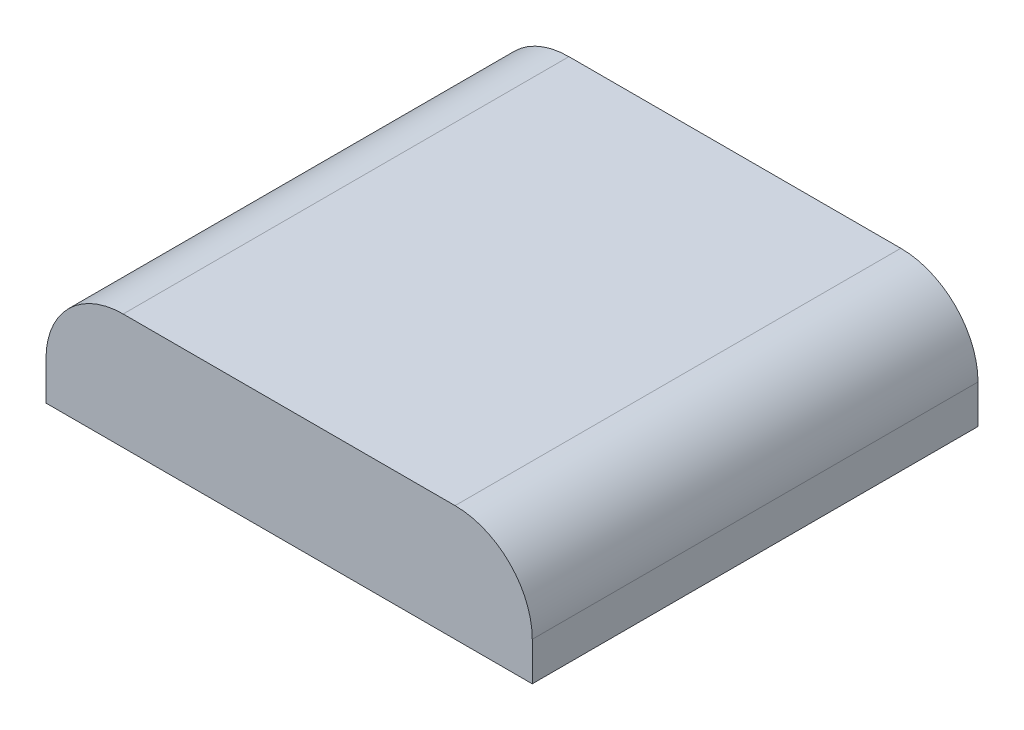
ISO-10303-21;
HEADER;
FILE_DESCRIPTION(('STEP AP214'),'2;1');
FILE_NAME('part.step','',(''),(''),'','','');
FILE_SCHEMA(('AUTOMOTIVE_DESIGN { 1 0 10303 214 1 1 1 1 }'));
ENDSEC;
DATA;
#1=APPLICATION_CONTEXT('core data for automotive mechanical design processes');
#2=APPLICATION_PROTOCOL_DEFINITION('international standard','automotive_design',2000,#1);
#3=PRODUCT_CONTEXT('',#1,'mechanical');
#4=PRODUCT('Part','Part','',(#3));
#5=PRODUCT_RELATED_PRODUCT_CATEGORY('part','',(#4));
#6=PRODUCT_DEFINITION_FORMATION('','',#4);
#7=PRODUCT_DEFINITION_CONTEXT('part definition',#1,'design');
#8=PRODUCT_DEFINITION('design','',#6,#7);
#9=PRODUCT_DEFINITION_SHAPE('','',#8);
#10=(LENGTH_UNIT() NAMED_UNIT(*) SI_UNIT(.MILLI.,.METRE.));
#11=(NAMED_UNIT(*) PLANE_ANGLE_UNIT() SI_UNIT($,.RADIAN.));
#12=(NAMED_UNIT(*) SI_UNIT($,.STERADIAN.) SOLID_ANGLE_UNIT());
#13=UNCERTAINTY_MEASURE_WITH_UNIT(LENGTH_MEASURE(1.E-05),#10,'distance_accuracy_value','');
#14=(GEOMETRIC_REPRESENTATION_CONTEXT(3) GLOBAL_UNCERTAINTY_ASSIGNED_CONTEXT((#13)) GLOBAL_UNIT_ASSIGNED_CONTEXT((#10,
#11,#12)) REPRESENTATION_CONTEXT('',''));
#15=CARTESIAN_POINT('',(0.,0.,0.));
#16=DIRECTION('',(0.,0.,1.));
#17=DIRECTION('',(1.,0.,0.));
#18=AXIS2_PLACEMENT_3D('',#15,#16,#17);
#19=CARTESIAN_POINT('',(31.5,15.,-28.875));
#20=DIRECTION('',(-1.,0.,0.));
#21=DIRECTION('',(0.,0.,1.));
#22=AXIS2_PLACEMENT_3D('',#19,#20,#21);
#23=PLANE('',#22);
#24=DIRECTION('',(0.,-1.,0.));
#25=VECTOR('',#24,1.);
#26=CARTESIAN_POINT('',(31.5,15.,-28.875));
#27=LINE('',#26,#25);
#28=CARTESIAN_POINT('',(31.5,5.,-28.875));
#29=VERTEX_POINT('',#28);
#30=CARTESIAN_POINT('',(31.5,0.,-28.875));
#31=VERTEX_POINT('',#30);
#32=EDGE_CURVE('E85',#29,#31,#27,.T.);
#33=ORIENTED_EDGE('',*,*,#32,.F.);
#34=DIRECTION('',(0.,0.,-1.));
#35=VECTOR('',#34,1.);
#36=CARTESIAN_POINT('',(31.5,5.,28.875));
#37=LINE('',#36,#35);
#38=CARTESIAN_POINT('',(31.5,5.,28.875));
#39=VERTEX_POINT('',#38);
#40=EDGE_CURVE('E56',#29,#39,#37,.F.);
#41=ORIENTED_EDGE('',*,*,#40,.T.);
#42=DIRECTION('',(0.,-1.,0.));
#43=VECTOR('',#42,1.);
#44=CARTESIAN_POINT('',(31.5,15.,28.875));
#45=LINE('',#44,#43);
#46=CARTESIAN_POINT('',(31.5,0.,28.875));
#47=VERTEX_POINT('',#46);
#48=EDGE_CURVE('E105',#39,#47,#45,.T.);
#49=ORIENTED_EDGE('',*,*,#48,.T.);
#50=DIRECTION('',(0.,0.,-1.));
#51=VECTOR('',#50,1.);
#52=CARTESIAN_POINT('',(31.5,0.,-28.875));
#53=LINE('',#52,#51);
#54=EDGE_CURVE('E101',#47,#31,#53,.T.);
#55=ORIENTED_EDGE('',*,*,#54,.T.);
#56=EDGE_LOOP('',(#33,#41,#49,#55));
#57=FACE_BOUND('',#56,.T.);
#58=ADVANCED_FACE('F33',(#57),#23,.F.);
#59=CARTESIAN_POINT('',(-31.5,15.,-28.875));
#60=DIRECTION('',(0.,0.,1.));
#61=DIRECTION('',(1.,0.,0.));
#62=AXIS2_PLACEMENT_3D('',#59,#60,#61);
#63=PLANE('',#62);
#64=DIRECTION('',(-1.,0.,0.));
#65=VECTOR('',#64,1.);
#66=CARTESIAN_POINT('',(-31.5,15.,-28.875));
#67=LINE('',#66,#65);
#68=CARTESIAN_POINT('',(21.5,15.,-28.875));
#69=VERTEX_POINT('',#68);
#70=CARTESIAN_POINT('',(-21.5,15.,-28.875));
#71=VERTEX_POINT('',#70);
#72=EDGE_CURVE('E115',#69,#71,#67,.T.);
#73=ORIENTED_EDGE('',*,*,#72,.F.);
#74=CARTESIAN_POINT('',(21.5,5.,-28.875));
#75=DIRECTION('',(0.,0.,1.));
#76=DIRECTION('',(1.,0.,0.));
#77=AXIS2_PLACEMENT_3D('',#74,#75,#76);
#78=CIRCLE('',#77,10.);
#79=EDGE_CURVE('E92',#69,#29,#78,.F.);
#80=ORIENTED_EDGE('',*,*,#79,.T.);
#81=ORIENTED_EDGE('',*,*,#32,.T.);
#82=DIRECTION('',(-1.,0.,0.));
#83=VECTOR('',#82,1.);
#84=CARTESIAN_POINT('',(-31.5,0.,-28.875));
#85=LINE('',#84,#83);
#86=CARTESIAN_POINT('',(-31.5,0.,-28.875));
#87=VERTEX_POINT('',#86);
#88=EDGE_CURVE('E90',#31,#87,#85,.T.);
#89=ORIENTED_EDGE('',*,*,#88,.T.);
#90=DIRECTION('',(0.,-1.,0.));
#91=VECTOR('',#90,1.);
#92=CARTESIAN_POINT('',(-31.5,15.,-28.875));
#93=LINE('',#92,#91);
#94=CARTESIAN_POINT('',(-31.5,5.,-28.875));
#95=VERTEX_POINT('',#94);
#96=EDGE_CURVE('E95',#95,#87,#93,.T.);
#97=ORIENTED_EDGE('',*,*,#96,.F.);
#98=CARTESIAN_POINT('',(-21.5,5.,-28.875));
#99=DIRECTION('',(0.,0.,1.));
#100=DIRECTION('',(1.,0.,0.));
#101=AXIS2_PLACEMENT_3D('',#98,#99,#100);
#102=CIRCLE('',#101,10.);
#103=EDGE_CURVE('E125',#95,#71,#102,.F.);
#104=ORIENTED_EDGE('',*,*,#103,.T.);
#105=EDGE_LOOP('',(#73,#80,#81,#89,#97,#104));
#106=FACE_BOUND('',#105,.T.);
#107=ADVANCED_FACE('F88',(#106),#63,.F.);
#108=CARTESIAN_POINT('',(-31.5,15.,-28.875));
#109=DIRECTION('',(1.,0.,0.));
#110=DIRECTION('',(0.,0.,-1.));
#111=AXIS2_PLACEMENT_3D('',#108,#109,#110);
#112=PLANE('',#111);
#113=DIRECTION('',(0.,-1.,0.));
#114=VECTOR('',#113,1.);
#115=CARTESIAN_POINT('',(-31.5,15.,28.875));
#116=LINE('',#115,#114);
#117=CARTESIAN_POINT('',(-31.5,5.,28.875));
#118=VERTEX_POINT('',#117);
#119=CARTESIAN_POINT('',(-31.5,0.,28.875));
#120=VERTEX_POINT('',#119);
#121=EDGE_CURVE('E117',#118,#120,#116,.T.);
#122=ORIENTED_EDGE('',*,*,#121,.F.);
#123=DIRECTION('',(0.,0.,1.));
#124=VECTOR('',#123,1.);
#125=CARTESIAN_POINT('',(-31.5,5.,-28.875));
#126=LINE('',#125,#124);
#127=EDGE_CURVE('E11',#118,#95,#126,.F.);
#128=ORIENTED_EDGE('',*,*,#127,.T.);
#129=ORIENTED_EDGE('',*,*,#96,.T.);
#130=DIRECTION('',(0.,0.,1.));
#131=VECTOR('',#130,1.);
#132=CARTESIAN_POINT('',(-31.5,0.,-28.875));
#133=LINE('',#132,#131);
#134=EDGE_CURVE('E103',#87,#120,#133,.T.);
#135=ORIENTED_EDGE('',*,*,#134,.T.);
#136=EDGE_LOOP('',(#122,#128,#129,#135));
#137=FACE_BOUND('',#136,.T.);
#138=ADVANCED_FACE('F151',(#137),#112,.F.);
#139=CARTESIAN_POINT('',(-31.5,15.,28.875));
#140=DIRECTION('',(0.,0.,-1.));
#141=DIRECTION('',(-1.,0.,0.));
#142=AXIS2_PLACEMENT_3D('',#139,#140,#141);
#143=PLANE('',#142);
#144=ORIENTED_EDGE('',*,*,#48,.F.);
#145=CARTESIAN_POINT('',(21.5,5.,28.875));
#146=DIRECTION('',(0.,0.,-1.));
#147=DIRECTION('',(-1.,0.,0.));
#148=AXIS2_PLACEMENT_3D('',#145,#146,#147);
#149=CIRCLE('',#148,10.);
#150=CARTESIAN_POINT('',(21.5,15.,28.875));
#151=VERTEX_POINT('',#150);
#152=EDGE_CURVE('E41',#39,#151,#149,.F.);
#153=ORIENTED_EDGE('',*,*,#152,.T.);
#154=DIRECTION('',(1.,0.,0.));
#155=VECTOR('',#154,1.);
#156=CARTESIAN_POINT('',(-31.5,15.,28.875));
#157=LINE('',#156,#155);
#158=CARTESIAN_POINT('',(-21.5,15.,28.875));
#159=VERTEX_POINT('',#158);
#160=EDGE_CURVE('E109',#159,#151,#157,.T.);
#161=ORIENTED_EDGE('',*,*,#160,.F.);
#162=CARTESIAN_POINT('',(-21.5,5.,28.875));
#163=DIRECTION('',(0.,0.,-1.));
#164=DIRECTION('',(-1.,0.,0.));
#165=AXIS2_PLACEMENT_3D('',#162,#163,#164);
#166=CIRCLE('',#165,10.);
#167=EDGE_CURVE('E48',#159,#118,#166,.F.);
#168=ORIENTED_EDGE('',*,*,#167,.T.);
#169=ORIENTED_EDGE('',*,*,#121,.T.);
#170=DIRECTION('',(1.,0.,0.));
#171=VECTOR('',#170,1.);
#172=CARTESIAN_POINT('',(-31.5,0.,28.875));
#173=LINE('',#172,#171);
#174=EDGE_CURVE('E113',#120,#47,#173,.T.);
#175=ORIENTED_EDGE('',*,*,#174,.T.);
#176=EDGE_LOOP('',(#144,#153,#161,#168,#169,#175));
#177=FACE_BOUND('',#176,.T.);
#178=ADVANCED_FACE('F131',(#177),#143,.F.);
#179=CARTESIAN_POINT('',(0.,15.,0.));
#180=DIRECTION('',(0.,1.,0.));
#181=DIRECTION('',(0.,0.,1.));
#182=AXIS2_PLACEMENT_3D('',#179,#180,#181);
#183=PLANE('',#182);
#184=ORIENTED_EDGE('',*,*,#160,.T.);
#185=DIRECTION('',(0.,0.,-1.));
#186=VECTOR('',#185,1.);
#187=CARTESIAN_POINT('',(21.5,15.,-28.875));
#188=LINE('',#187,#186);
#189=EDGE_CURVE('E122',#151,#69,#188,.T.);
#190=ORIENTED_EDGE('',*,*,#189,.T.);
#191=ORIENTED_EDGE('',*,*,#72,.T.);
#192=DIRECTION('',(0.,0.,1.));
#193=VECTOR('',#192,1.);
#194=CARTESIAN_POINT('',(-21.5,15.,28.875));
#195=LINE('',#194,#193);
#196=EDGE_CURVE('E94',#71,#159,#195,.T.);
#197=ORIENTED_EDGE('',*,*,#196,.T.);
#198=EDGE_LOOP('',(#184,#190,#191,#197));
#199=FACE_BOUND('',#198,.T.);
#200=ADVANCED_FACE('F135',(#199),#183,.T.);
#201=CARTESIAN_POINT('',(0.,0.,0.));
#202=DIRECTION('',(0.,1.,0.));
#203=DIRECTION('',(0.,0.,1.));
#204=AXIS2_PLACEMENT_3D('',#201,#202,#203);
#205=PLANE('',#204);
#206=ORIENTED_EDGE('',*,*,#54,.F.);
#207=ORIENTED_EDGE('',*,*,#174,.F.);
#208=ORIENTED_EDGE('',*,*,#134,.F.);
#209=ORIENTED_EDGE('',*,*,#88,.F.);
#210=EDGE_LOOP('',(#206,#207,#208,#209));
#211=FACE_BOUND('',#210,.T.);
#212=ADVANCED_FACE('F99',(#211),#205,.F.);
#213=CARTESIAN_POINT('',(21.5,5.,0.));
#214=DIRECTION('',(0.,0.,1.));
#215=DIRECTION('',(1.,0.,0.));
#216=AXIS2_PLACEMENT_3D('',#213,#214,#215);
#217=CYLINDRICAL_SURFACE('',#216,10.);
#218=ORIENTED_EDGE('',*,*,#152,.F.);
#219=ORIENTED_EDGE('',*,*,#40,.F.);
#220=ORIENTED_EDGE('',*,*,#79,.F.);
#221=ORIENTED_EDGE('',*,*,#189,.F.);
#222=EDGE_LOOP('',(#218,#219,#220,#221));
#223=FACE_BOUND('',#222,.T.);
#224=ADVANCED_FACE('F138',(#223),#217,.T.);
#225=CARTESIAN_POINT('',(-21.5,5.,0.));
#226=DIRECTION('',(0.,0.,-1.));
#227=DIRECTION('',(-1.,0.,0.));
#228=AXIS2_PLACEMENT_3D('',#225,#226,#227);
#229=CYLINDRICAL_SURFACE('',#228,10.);
#230=ORIENTED_EDGE('',*,*,#103,.F.);
#231=ORIENTED_EDGE('',*,*,#127,.F.);
#232=ORIENTED_EDGE('',*,*,#167,.F.);
#233=ORIENTED_EDGE('',*,*,#196,.F.);
#234=EDGE_LOOP('',(#230,#231,#232,#233));
#235=FACE_BOUND('',#234,.T.);
#236=ADVANCED_FACE('F35',(#235),#229,.T.);
#237=CLOSED_SHELL('',(#58,#107,#138,#178,#200,#212,#224,#236));
#238=MANIFOLD_SOLID_BREP('B2',#237);
#239=ADVANCED_BREP_SHAPE_REPRESENTATION('',(#18,#238),#14);
#240=SHAPE_DEFINITION_REPRESENTATION(#9,#239);
ENDSEC;
END-ISO-10303-21;
